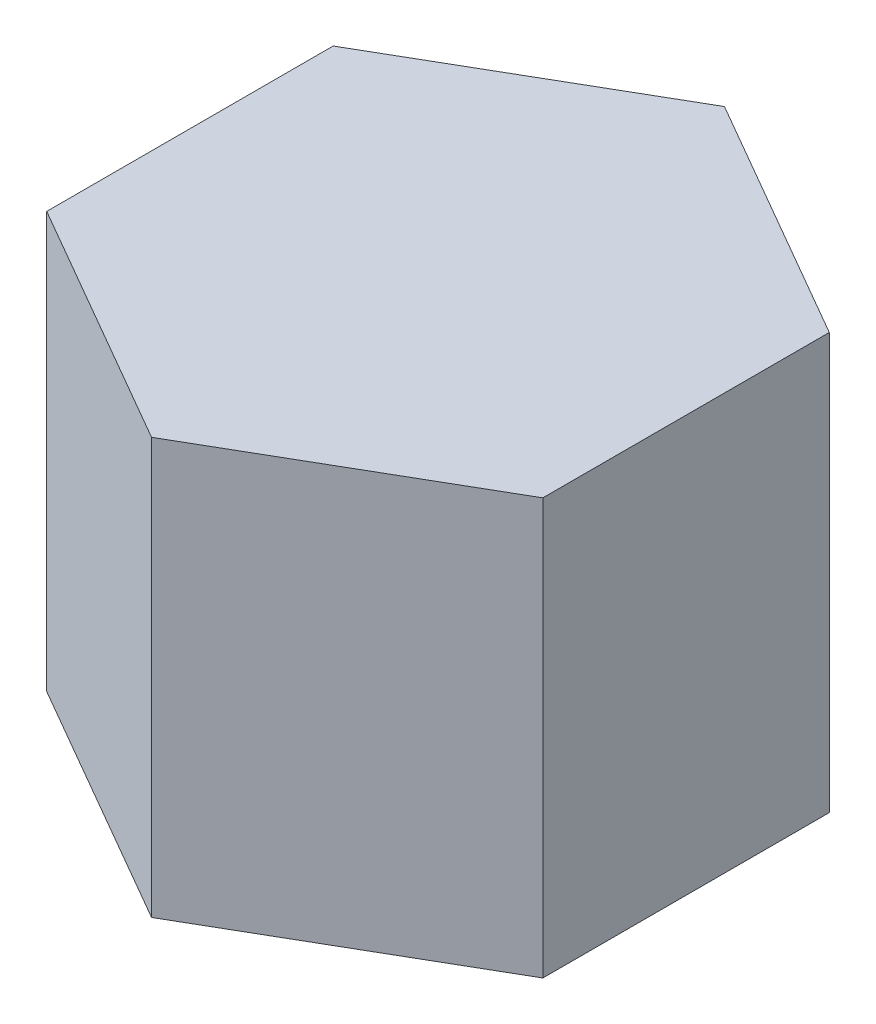
ISO-10303-21;
HEADER;
FILE_DESCRIPTION(('STEP AP214'),'2;1');
FILE_NAME('part.step','',(''),(''),'','','');
FILE_SCHEMA(('AUTOMOTIVE_DESIGN { 1 0 10303 214 1 1 1 1 }'));
ENDSEC;
DATA;
#1=APPLICATION_CONTEXT('core data for automotive mechanical design processes');
#2=APPLICATION_PROTOCOL_DEFINITION('international standard','automotive_design',2000,#1);
#3=PRODUCT_CONTEXT('',#1,'mechanical');
#4=PRODUCT('Part','Part','',(#3));
#5=PRODUCT_RELATED_PRODUCT_CATEGORY('part','',(#4));
#6=PRODUCT_DEFINITION_FORMATION('','',#4);
#7=PRODUCT_DEFINITION_CONTEXT('part definition',#1,'design');
#8=PRODUCT_DEFINITION('design','',#6,#7);
#9=PRODUCT_DEFINITION_SHAPE('','',#8);
#10=(LENGTH_UNIT() NAMED_UNIT(*) SI_UNIT(.MILLI.,.METRE.));
#11=(NAMED_UNIT(*) PLANE_ANGLE_UNIT() SI_UNIT($,.RADIAN.));
#12=(NAMED_UNIT(*) SI_UNIT($,.STERADIAN.) SOLID_ANGLE_UNIT());
#13=UNCERTAINTY_MEASURE_WITH_UNIT(LENGTH_MEASURE(1.E-05),#10,'distance_accuracy_value','');
#14=(GEOMETRIC_REPRESENTATION_CONTEXT(3) GLOBAL_UNCERTAINTY_ASSIGNED_CONTEXT((#13)) GLOBAL_UNIT_ASSIGNED_CONTEXT((#10,
#11,#12)) REPRESENTATION_CONTEXT('',''));
#15=CARTESIAN_POINT('',(0.,0.,0.));
#16=DIRECTION('',(0.,0.,1.));
#17=DIRECTION('',(1.,0.,0.));
#18=AXIS2_PLACEMENT_3D('',#15,#16,#17);
#19=CARTESIAN_POINT('',(209.142660308706,-148.537700895744,288.908895009141));
#20=DIRECTION('',(-0.499999999999943,0.,-0.866025403784472));
#21=DIRECTION('',(-0.866025403784472,0.,0.499999999999943));
#22=AXIS2_PLACEMENT_3D('',#19,#20,#21);
#23=PLANE('',#22);
#24=CARTESIAN_POINT('',(208.839551417382,-149.045793579175,289.083895009141));
#25=DIRECTION('',(0.866025403784471,0.,-0.499999999999943));
#26=VECTOR('',#25,1.);
#27=LINE('',#24,#26);
#28=CARTESIAN_POINT('',(208.839551417382,-149.045793579175,289.083895009141));
#29=VERTEX_POINT('',#28);
#30=CARTESIAN_POINT('',(209.142660308706,-149.045793579175,288.908895009141));
#31=VERTEX_POINT('',#30);
#32=EDGE_CURVE('E170',#29,#31,#27,.T.);
#33=ORIENTED_EDGE('',*,*,#32,.T.);
#34=CARTESIAN_POINT('',(209.142660308706,-148.537700895744,288.908895009141));
#35=DIRECTION('',(0.,-1.,0.));
#36=VECTOR('',#35,1.);
#37=LINE('',#34,#36);
#38=CARTESIAN_POINT('',(209.142660308706,-148.537700895744,288.908895009141));
#39=VERTEX_POINT('',#38);
#40=EDGE_CURVE('E35',#39,#31,#37,.T.);
#41=ORIENTED_EDGE('',*,*,#40,.F.);
#42=CARTESIAN_POINT('',(208.839551417382,-148.537700895744,289.083895009141));
#43=DIRECTION('',(0.866025403784471,0.,-0.499999999999943));
#44=VECTOR('',#43,1.);
#45=LINE('',#42,#44);
#46=CARTESIAN_POINT('',(208.839551417382,-148.537700895744,289.083895009141));
#47=VERTEX_POINT('',#46);
#48=EDGE_CURVE('E159',#47,#39,#45,.T.);
#49=ORIENTED_EDGE('',*,*,#48,.F.);
#50=CARTESIAN_POINT('',(208.839551417382,-148.537700895744,289.083895009141));
#51=DIRECTION('',(0.,-1.,0.));
#52=VECTOR('',#51,1.);
#53=LINE('',#50,#52);
#54=EDGE_CURVE('E10',#47,#29,#53,.T.);
#55=ORIENTED_EDGE('',*,*,#54,.T.);
#56=EDGE_LOOP('',(#33,#41,#49,#55));
#57=FACE_BOUND('',#56,.T.);
#58=ADVANCED_FACE('F16',(#57),#23,.F.);
#59=CARTESIAN_POINT('',(208.839551417382,-148.537700895744,289.083895009141));
#60=DIRECTION('',(0.500000000000062,0.,-0.866025403784403));
#61=DIRECTION('',(-0.866025403784403,0.,-0.500000000000062));
#62=AXIS2_PLACEMENT_3D('',#59,#60,#61);
#63=PLANE('',#62);
#64=CARTESIAN_POINT('',(208.536442526057,-149.045793579175,288.908895009141));
#65=DIRECTION('',(0.866025403784403,0.,0.500000000000062));
#66=VECTOR('',#65,1.);
#67=LINE('',#64,#66);
#68=CARTESIAN_POINT('',(208.536442526057,-149.045793579175,288.908895009141));
#69=VERTEX_POINT('',#68);
#70=EDGE_CURVE('E167',#69,#29,#67,.T.);
#71=ORIENTED_EDGE('',*,*,#70,.T.);
#72=ORIENTED_EDGE('',*,*,#54,.F.);
#73=CARTESIAN_POINT('',(208.536442526057,-148.537700895744,288.908895009141));
#74=DIRECTION('',(0.866025403784403,0.,0.500000000000062));
#75=VECTOR('',#74,1.);
#76=LINE('',#73,#75);
#77=CARTESIAN_POINT('',(208.536442526057,-148.537700895744,288.908895009141));
#78=VERTEX_POINT('',#77);
#79=EDGE_CURVE('E156',#78,#47,#76,.T.);
#80=ORIENTED_EDGE('',*,*,#79,.F.);
#81=CARTESIAN_POINT('',(208.536442526057,-148.537700895744,288.908895009141));
#82=DIRECTION('',(0.,-1.,0.));
#83=VECTOR('',#82,1.);
#84=LINE('',#81,#83);
#85=EDGE_CURVE('E27',#78,#69,#84,.T.);
#86=ORIENTED_EDGE('',*,*,#85,.T.);
#87=EDGE_LOOP('',(#71,#72,#80,#86));
#88=FACE_BOUND('',#87,.T.);
#89=ADVANCED_FACE('F189',(#88),#63,.F.);
#90=CARTESIAN_POINT('',(208.536442526057,-148.537700895744,290.831971220494));
#91=DIRECTION('',(1.,0.,0.));
#92=DIRECTION('',(0.,1.,0.));
#93=AXIS2_PLACEMENT_3D('',#90,#91,#92);
#94=PLANE('',#93);
#95=CARTESIAN_POINT('',(208.536442526057,-149.045793579175,288.558895009141));
#96=DIRECTION('',(0.,0.,1.));
#97=VECTOR('',#96,1.);
#98=LINE('',#95,#97);
#99=CARTESIAN_POINT('',(208.536442526057,-149.045793579175,288.558895009141));
#100=VERTEX_POINT('',#99);
#101=EDGE_CURVE('E163',#100,#69,#98,.T.);
#102=ORIENTED_EDGE('',*,*,#101,.T.);
#103=ORIENTED_EDGE('',*,*,#85,.F.);
#104=CARTESIAN_POINT('',(208.536442526057,-148.537700895744,288.558895009141));
#105=DIRECTION('',(0.,0.,1.));
#106=VECTOR('',#105,1.);
#107=LINE('',#104,#106);
#108=CARTESIAN_POINT('',(208.536442526057,-148.537700895744,288.558895009141));
#109=VERTEX_POINT('',#108);
#110=EDGE_CURVE('E106',#109,#78,#107,.T.);
#111=ORIENTED_EDGE('',*,*,#110,.F.);
#112=CARTESIAN_POINT('',(208.536442526057,-148.537700895744,288.558895009141));
#113=DIRECTION('',(0.,-1.,0.));
#114=VECTOR('',#113,1.);
#115=LINE('',#112,#114);
#116=EDGE_CURVE('E94',#109,#100,#115,.T.);
#117=ORIENTED_EDGE('',*,*,#116,.T.);
#118=EDGE_LOOP('',(#102,#103,#111,#117));
#119=FACE_BOUND('',#118,.T.);
#120=ADVANCED_FACE('F198',(#119),#94,.F.);
#121=CARTESIAN_POINT('',(208.536442526057,-148.537700895744,288.558895009141));
#122=DIRECTION('',(0.499999999999978,0.,0.866025403784452));
#123=DIRECTION('',(0.866025403784452,0.,-0.499999999999978));
#124=AXIS2_PLACEMENT_3D('',#121,#122,#123);
#125=PLANE('',#124);
#126=CARTESIAN_POINT('',(208.839551417382,-149.045793579175,288.383895009141));
#127=DIRECTION('',(-0.866025403784452,0.,0.499999999999978));
#128=VECTOR('',#127,1.);
#129=LINE('',#126,#128);
#130=CARTESIAN_POINT('',(208.839551417382,-149.045793579175,288.383895009141));
#131=VERTEX_POINT('',#130);
#132=EDGE_CURVE('E162',#131,#100,#129,.T.);
#133=ORIENTED_EDGE('',*,*,#132,.T.);
#134=ORIENTED_EDGE('',*,*,#116,.F.);
#135=CARTESIAN_POINT('',(208.839551417382,-148.537700895744,288.383895009141));
#136=DIRECTION('',(-0.866025403784452,0.,0.499999999999978));
#137=VECTOR('',#136,1.);
#138=LINE('',#135,#137);
#139=CARTESIAN_POINT('',(208.839551417382,-148.537700895744,288.383895009141));
#140=VERTEX_POINT('',#139);
#141=EDGE_CURVE('E98',#140,#109,#138,.T.);
#142=ORIENTED_EDGE('',*,*,#141,.F.);
#143=CARTESIAN_POINT('',(208.839551417382,-148.537700895744,288.383895009141));
#144=DIRECTION('',(0.,-1.,0.));
#145=VECTOR('',#144,1.);
#146=LINE('',#143,#145);
#147=EDGE_CURVE('E79',#140,#131,#146,.T.);
#148=ORIENTED_EDGE('',*,*,#147,.T.);
#149=EDGE_LOOP('',(#133,#134,#142,#148));
#150=FACE_BOUND('',#149,.T.);
#151=ADVANCED_FACE('F100',(#150),#125,.F.);
#152=CARTESIAN_POINT('',(208.839551417382,-148.537700895744,288.383895009141));
#153=DIRECTION('',(-0.499999999999943,0.,0.866025403784472));
#154=DIRECTION('',(0.866025403784472,0.,0.499999999999943));
#155=AXIS2_PLACEMENT_3D('',#152,#153,#154);
#156=PLANE('',#155);
#157=CARTESIAN_POINT('',(209.142660308706,-149.045793579175,288.558895009141));
#158=DIRECTION('',(-0.866025403784471,0.,-0.499999999999943));
#159=VECTOR('',#158,1.);
#160=LINE('',#157,#159);
#161=CARTESIAN_POINT('',(209.142660308706,-149.045793579175,288.558895009141));
#162=VERTEX_POINT('',#161);
#163=EDGE_CURVE('E88',#162,#131,#160,.T.);
#164=ORIENTED_EDGE('',*,*,#163,.T.);
#165=ORIENTED_EDGE('',*,*,#147,.F.);
#166=CARTESIAN_POINT('',(209.142660308706,-148.537700895744,288.558895009141));
#167=DIRECTION('',(-0.866025403784471,0.,-0.499999999999943));
#168=VECTOR('',#167,1.);
#169=LINE('',#166,#168);
#170=CARTESIAN_POINT('',(209.142660308706,-148.537700895744,288.558895009141));
#171=VERTEX_POINT('',#170);
#172=EDGE_CURVE('E84',#171,#140,#169,.T.);
#173=ORIENTED_EDGE('',*,*,#172,.F.);
#174=CARTESIAN_POINT('',(209.142660308706,-148.537700895744,288.558895009141));
#175=DIRECTION('',(0.,-1.,0.));
#176=VECTOR('',#175,1.);
#177=LINE('',#174,#176);
#178=EDGE_CURVE('E58',#171,#162,#177,.T.);
#179=ORIENTED_EDGE('',*,*,#178,.T.);
#180=EDGE_LOOP('',(#164,#165,#173,#179));
#181=FACE_BOUND('',#180,.T.);
#182=ADVANCED_FACE('F82',(#181),#156,.F.);
#183=CARTESIAN_POINT('',(209.142660308706,-148.537700895744,290.831971220494));
#184=DIRECTION('',(-1.,0.,0.));
#185=DIRECTION('',(0.,-1.,0.));
#186=AXIS2_PLACEMENT_3D('',#183,#184,#185);
#187=PLANE('',#186);
#188=CARTESIAN_POINT('',(209.142660308706,-149.045793579175,288.908895009141));
#189=DIRECTION('',(0.,0.,-1.));
#190=VECTOR('',#189,1.);
#191=LINE('',#188,#190);
#192=EDGE_CURVE('E160',#31,#162,#191,.T.);
#193=ORIENTED_EDGE('',*,*,#192,.T.);
#194=ORIENTED_EDGE('',*,*,#178,.F.);
#195=CARTESIAN_POINT('',(209.142660308706,-148.537700895744,288.908895009141));
#196=DIRECTION('',(0.,0.,-1.));
#197=VECTOR('',#196,1.);
#198=LINE('',#195,#197);
#199=EDGE_CURVE('E112',#39,#171,#198,.T.);
#200=ORIENTED_EDGE('',*,*,#199,.F.);
#201=ORIENTED_EDGE('',*,*,#40,.T.);
#202=EDGE_LOOP('',(#193,#194,#200,#201));
#203=FACE_BOUND('',#202,.T.);
#204=ADVANCED_FACE('F131',(#203),#187,.F.);
#205=CARTESIAN_POINT('',(206.339551417382,-148.537700895744,290.831971220494));
#206=DIRECTION('',(0.,-1.,0.));
#207=DIRECTION('',(1.,0.,0.));
#208=AXIS2_PLACEMENT_3D('',#205,#206,#207);
#209=PLANE('',#208);
#210=ORIENTED_EDGE('',*,*,#48,.T.);
#211=ORIENTED_EDGE('',*,*,#199,.T.);
#212=ORIENTED_EDGE('',*,*,#172,.T.);
#213=ORIENTED_EDGE('',*,*,#141,.T.);
#214=ORIENTED_EDGE('',*,*,#110,.T.);
#215=ORIENTED_EDGE('',*,*,#79,.T.);
#216=EDGE_LOOP('',(#210,#211,#212,#213,#214,#215));
#217=FACE_BOUND('',#216,.T.);
#218=ADVANCED_FACE('F111',(#217),#209,.F.);
#219=CARTESIAN_POINT('',(206.339551417382,-149.045793579175,290.831971220494));
#220=DIRECTION('',(0.,-1.,0.));
#221=DIRECTION('',(1.,0.,0.));
#222=AXIS2_PLACEMENT_3D('',#219,#220,#221);
#223=PLANE('',#222);
#224=ORIENTED_EDGE('',*,*,#32,.F.);
#225=ORIENTED_EDGE('',*,*,#70,.F.);
#226=ORIENTED_EDGE('',*,*,#101,.F.);
#227=ORIENTED_EDGE('',*,*,#132,.F.);
#228=ORIENTED_EDGE('',*,*,#163,.F.);
#229=ORIENTED_EDGE('',*,*,#192,.F.);
#230=EDGE_LOOP('',(#224,#225,#226,#227,#228,#229));
#231=FACE_BOUND('',#230,.T.);
#232=ADVANCED_FACE('F130',(#231),#223,.T.);
#233=CLOSED_SHELL('',(#58,#89,#120,#151,#182,#204,#218,#232));
#234=MANIFOLD_SOLID_BREP('B1',#233);
#235=ADVANCED_BREP_SHAPE_REPRESENTATION('',(#18,#234),#14);
#236=SHAPE_DEFINITION_REPRESENTATION(#9,#235);
ENDSEC;
END-ISO-10303-21;
